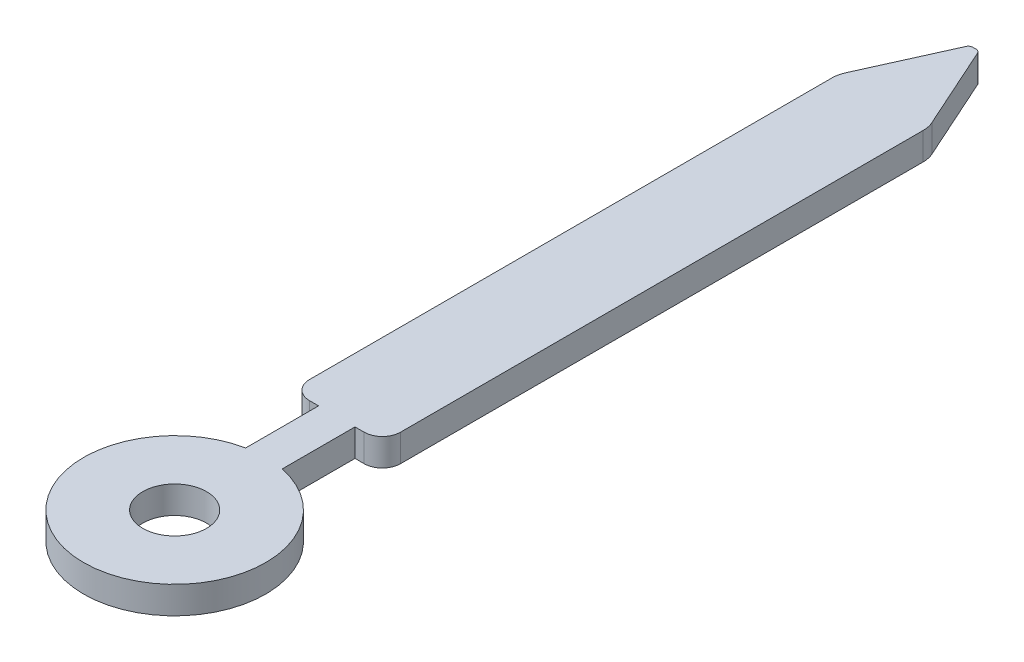
ISO-10303-21;
HEADER;
FILE_DESCRIPTION(('STEP AP214'),'2;1');
FILE_NAME('part.step','',(''),(''),'','','');
FILE_SCHEMA(('AUTOMOTIVE_DESIGN { 1 0 10303 214 1 1 1 1 }'));
ENDSEC;
DATA;
#1=APPLICATION_CONTEXT('core data for automotive mechanical design processes');
#2=APPLICATION_PROTOCOL_DEFINITION('international standard','automotive_design',2000,#1);
#3=PRODUCT_CONTEXT('',#1,'mechanical');
#4=PRODUCT('Part','Part','',(#3));
#5=PRODUCT_RELATED_PRODUCT_CATEGORY('part','',(#4));
#6=PRODUCT_DEFINITION_FORMATION('','',#4);
#7=PRODUCT_DEFINITION_CONTEXT('part definition',#1,'design');
#8=PRODUCT_DEFINITION('design','',#6,#7);
#9=PRODUCT_DEFINITION_SHAPE('','',#8);
#10=(LENGTH_UNIT() NAMED_UNIT(*) SI_UNIT(.MILLI.,.METRE.));
#11=(NAMED_UNIT(*) PLANE_ANGLE_UNIT() SI_UNIT($,.RADIAN.));
#12=(NAMED_UNIT(*) SI_UNIT($,.STERADIAN.) SOLID_ANGLE_UNIT());
#13=UNCERTAINTY_MEASURE_WITH_UNIT(LENGTH_MEASURE(1.E-05),#10,'distance_accuracy_value','');
#14=(GEOMETRIC_REPRESENTATION_CONTEXT(3) GLOBAL_UNCERTAINTY_ASSIGNED_CONTEXT((#13)) GLOBAL_UNIT_ASSIGNED_CONTEXT((#10,
#11,#12)) REPRESENTATION_CONTEXT('',''));
#15=CARTESIAN_POINT('',(0.,0.,0.));
#16=DIRECTION('',(0.,0.,1.));
#17=DIRECTION('',(1.,0.,0.));
#18=AXIS2_PLACEMENT_3D('',#15,#16,#17);
#19=CARTESIAN_POINT('',(-0.0183173051113198,0.3,-6.951));
#20=DIRECTION('',(0.,-1.,0.));
#21=DIRECTION('',(0.,0.,-1.));
#22=AXIS2_PLACEMENT_3D('',#19,#20,#21);
#23=PLANE('',#22);
#24=CARTESIAN_POINT('',(-0.0183173051113198,0.3,-6.951));
#25=DIRECTION('',(0.,1.,0.));
#26=DIRECTION('',(0.,0.,-1.));
#27=AXIS2_PLACEMENT_3D('',#24,#25,#26);
#28=CIRCLE('',#27,0.0489999999999997);
#29=CARTESIAN_POINT('',(-0.0183173051113195,0.3,-7.));
#30=VERTEX_POINT('',#29);
#31=CARTESIAN_POINT('',(-0.0630014588649001,0.3,-6.97110786918911));
#32=VERTEX_POINT('',#31);
#33=EDGE_CURVE('E207',#30,#32,#28,.T.);
#34=ORIENTED_EDGE('',*,*,#33,.T.);
#35=DIRECTION('',(-0.410364677328798,0.,0.911921505175106));
#36=VECTOR('',#35,1.);
#37=CARTESIAN_POINT('',(-0.0630014588649001,0.3,-6.97110786918911));
#38=LINE('',#37,#36);
#39=CARTESIAN_POINT('',(-0.473576451552531,0.3,-6.05871899654993));
#40=VERTEX_POINT('',#39);
#41=EDGE_CURVE('E115',#32,#40,#38,.T.);
#42=ORIENTED_EDGE('',*,*,#41,.T.);
#43=CARTESIAN_POINT('',(-0.2,0.3,-5.93560959335129));
#44=DIRECTION('',(0.,1.,0.));
#45=DIRECTION('',(0.,0.,1.));
#46=AXIS2_PLACEMENT_3D('',#43,#44,#45);
#47=CIRCLE('',#46,0.3);
#48=CARTESIAN_POINT('',(-0.5,0.3,-5.93560959335129));
#49=VERTEX_POINT('',#48);
#50=EDGE_CURVE('E246',#40,#49,#47,.T.);
#51=ORIENTED_EDGE('',*,*,#50,.T.);
#52=DIRECTION('',(0.,0.,1.));
#53=VECTOR('',#52,1.);
#54=CARTESIAN_POINT('',(-0.5,0.3,-0.200000000000001));
#55=LINE('',#54,#53);
#56=CARTESIAN_POINT('',(-0.5,0.3,-0.200000000000001));
#57=VERTEX_POINT('',#56);
#58=EDGE_CURVE('E265',#49,#57,#55,.T.);
#59=ORIENTED_EDGE('',*,*,#58,.T.);
#60=CARTESIAN_POINT('',(-0.3,0.3,-0.2));
#61=DIRECTION('',(0.,1.,0.));
#62=DIRECTION('',(0.,0.,-1.));
#63=AXIS2_PLACEMENT_3D('',#60,#61,#62);
#64=CIRCLE('',#63,0.2);
#65=CARTESIAN_POINT('',(-0.299999999999999,0.3,0.));
#66=VERTEX_POINT('',#65);
#67=EDGE_CURVE('E262',#57,#66,#64,.T.);
#68=ORIENTED_EDGE('',*,*,#67,.T.);
#69=DIRECTION('',(1.,0.,0.));
#70=VECTOR('',#69,1.);
#71=CARTESIAN_POINT('',(-0.299999999999999,0.3,0.));
#72=LINE('',#71,#70);
#73=CARTESIAN_POINT('',(-0.2,0.3,0.));
#74=VERTEX_POINT('',#73);
#75=EDGE_CURVE('E264',#66,#74,#72,.T.);
#76=ORIENTED_EDGE('',*,*,#75,.T.);
#77=DIRECTION('',(0.,0.,1.));
#78=VECTOR('',#77,1.);
#79=CARTESIAN_POINT('',(-0.2,0.3,0.));
#80=LINE('',#79,#78);
#81=CARTESIAN_POINT('',(-0.199999999999999,0.3,0.8));
#82=VERTEX_POINT('',#81);
#83=EDGE_CURVE('E267',#74,#82,#80,.T.);
#84=ORIENTED_EDGE('',*,*,#83,.T.);
#85=CARTESIAN_POINT('',(0.,0.3,1.77979589711327));
#86=DIRECTION('',(0.,1.,0.));
#87=DIRECTION('',(0.,0.,1.));
#88=AXIS2_PLACEMENT_3D('',#85,#86,#87);
#89=CIRCLE('',#88,1.);
#90=CARTESIAN_POINT('',(0.200000000000001,0.3,0.8));
#91=VERTEX_POINT('',#90);
#92=EDGE_CURVE('E273',#82,#91,#89,.T.);
#93=ORIENTED_EDGE('',*,*,#92,.T.);
#94=DIRECTION('',(0.,0.,-1.));
#95=VECTOR('',#94,1.);
#96=CARTESIAN_POINT('',(0.2,0.3,0.));
#97=LINE('',#96,#95);
#98=CARTESIAN_POINT('',(0.2,0.3,0.));
#99=VERTEX_POINT('',#98);
#100=EDGE_CURVE('E275',#91,#99,#97,.T.);
#101=ORIENTED_EDGE('',*,*,#100,.T.);
#102=DIRECTION('',(1.,0.,0.));
#103=VECTOR('',#102,1.);
#104=CARTESIAN_POINT('',(0.2,0.3,0.));
#105=LINE('',#104,#103);
#106=CARTESIAN_POINT('',(0.299999999999999,0.3,0.));
#107=VERTEX_POINT('',#106);
#108=EDGE_CURVE('E277',#99,#107,#105,.T.);
#109=ORIENTED_EDGE('',*,*,#108,.T.);
#110=CARTESIAN_POINT('',(0.3,0.3,-0.2));
#111=DIRECTION('',(0.,1.,0.));
#112=DIRECTION('',(0.,0.,1.));
#113=AXIS2_PLACEMENT_3D('',#110,#111,#112);
#114=CIRCLE('',#113,0.2);
#115=CARTESIAN_POINT('',(0.5,0.3,-0.200000000000001));
#116=VERTEX_POINT('',#115);
#117=EDGE_CURVE('E279',#107,#116,#114,.T.);
#118=ORIENTED_EDGE('',*,*,#117,.T.);
#119=DIRECTION('',(0.,0.,-1.));
#120=VECTOR('',#119,1.);
#121=CARTESIAN_POINT('',(0.5,0.3,-0.200000000000001));
#122=LINE('',#121,#120);
#123=CARTESIAN_POINT('',(0.5,0.3,-5.93560959335129));
#124=VERTEX_POINT('',#123);
#125=EDGE_CURVE('E281',#116,#124,#122,.T.);
#126=ORIENTED_EDGE('',*,*,#125,.T.);
#127=CARTESIAN_POINT('',(0.2,0.3,-5.93560959335129));
#128=DIRECTION('',(0.,1.,0.));
#129=DIRECTION('',(0.,0.,-1.));
#130=AXIS2_PLACEMENT_3D('',#127,#128,#129);
#131=CIRCLE('',#130,0.3);
#132=CARTESIAN_POINT('',(0.473576451552531,0.3,-6.05871899654993));
#133=VERTEX_POINT('',#132);
#134=EDGE_CURVE('E158',#124,#133,#131,.T.);
#135=ORIENTED_EDGE('',*,*,#134,.T.);
#136=DIRECTION('',(-0.410364677328798,0.,-0.911921505175106));
#137=VECTOR('',#136,1.);
#138=CARTESIAN_POINT('',(0.0630014588649001,0.3,-6.97110786918911));
#139=LINE('',#138,#137);
#140=CARTESIAN_POINT('',(0.0630014588649001,0.3,-6.97110786918911));
#141=VERTEX_POINT('',#140);
#142=EDGE_CURVE('E152',#133,#141,#139,.T.);
#143=ORIENTED_EDGE('',*,*,#142,.T.);
#144=CARTESIAN_POINT('',(0.0183173051113198,0.3,-6.951));
#145=DIRECTION('',(0.,1.,0.));
#146=DIRECTION('',(0.,0.,1.));
#147=AXIS2_PLACEMENT_3D('',#144,#145,#146);
#148=CIRCLE('',#147,0.0489999999999997);
#149=CARTESIAN_POINT('',(0.0183173051113196,0.3,-7.));
#150=VERTEX_POINT('',#149);
#151=EDGE_CURVE('E156',#141,#150,#148,.T.);
#152=ORIENTED_EDGE('',*,*,#151,.T.);
#153=DIRECTION('',(-1.,0.,0.));
#154=VECTOR('',#153,1.);
#155=CARTESIAN_POINT('',(-0.0183173051113195,0.3,-7.));
#156=LINE('',#155,#154);
#157=EDGE_CURVE('E48',#150,#30,#156,.T.);
#158=ORIENTED_EDGE('',*,*,#157,.T.);
#159=EDGE_LOOP('',(#34,#42,#51,#59,#68,#76,#84,#93,#101,#109,#118,#126,#135,#143,#152,#158));
#160=FACE_BOUND('',#159,.T.);
#161=CARTESIAN_POINT('',(0.,0.3,1.77979589711327));
#162=DIRECTION('',(0.,1.,0.));
#163=DIRECTION('',(0.,0.,1.));
#164=AXIS2_PLACEMENT_3D('',#161,#162,#163);
#165=CIRCLE('',#164,0.35);
#166=CARTESIAN_POINT('',(0.,0.3,2.12979589711327));
#167=VERTEX_POINT('',#166);
#168=EDGE_CURVE('E180',#167,#167,#165,.T.);
#169=ORIENTED_EDGE('',*,*,#168,.F.);
#170=EDGE_LOOP('',(#169));
#171=FACE_BOUND('',#170,.T.);
#172=ADVANCED_FACE('F31',(#160,#171),#23,.F.);
#173=CARTESIAN_POINT('',(-0.0183173051113198,0.,-6.951));
#174=DIRECTION('',(0.,-1.,0.));
#175=DIRECTION('',(0.,0.,-1.));
#176=AXIS2_PLACEMENT_3D('',#173,#174,#175);
#177=PLANE('',#176);
#178=CARTESIAN_POINT('',(-0.0183173051113198,0.,-6.951));
#179=DIRECTION('',(0.,1.,0.));
#180=DIRECTION('',(0.,0.,-1.));
#181=AXIS2_PLACEMENT_3D('',#178,#179,#180);
#182=CIRCLE('',#181,0.0489999999999997);
#183=CARTESIAN_POINT('',(-0.0183173051113195,0.,-7.));
#184=VERTEX_POINT('',#183);
#185=CARTESIAN_POINT('',(-0.0630014588649001,0.,-6.97110786918911));
#186=VERTEX_POINT('',#185);
#187=EDGE_CURVE('E176',#184,#186,#182,.T.);
#188=ORIENTED_EDGE('',*,*,#187,.F.);
#189=DIRECTION('',(-1.,0.,0.));
#190=VECTOR('',#189,1.);
#191=CARTESIAN_POINT('',(-0.0183173051113195,0.,-7.));
#192=LINE('',#191,#190);
#193=CARTESIAN_POINT('',(0.0183173051113196,0.,-7.));
#194=VERTEX_POINT('',#193);
#195=EDGE_CURVE('E107',#194,#184,#192,.T.);
#196=ORIENTED_EDGE('',*,*,#195,.F.);
#197=CARTESIAN_POINT('',(0.0183173051113198,0.,-6.951));
#198=DIRECTION('',(0.,1.,0.));
#199=DIRECTION('',(0.,0.,1.));
#200=AXIS2_PLACEMENT_3D('',#197,#198,#199);
#201=CIRCLE('',#200,0.0489999999999997);
#202=CARTESIAN_POINT('',(0.0630014588649001,0.,-6.97110786918911));
#203=VERTEX_POINT('',#202);
#204=EDGE_CURVE('E101',#203,#194,#201,.T.);
#205=ORIENTED_EDGE('',*,*,#204,.F.);
#206=DIRECTION('',(-0.410364677328798,0.,-0.911921505175106));
#207=VECTOR('',#206,1.);
#208=CARTESIAN_POINT('',(0.0630014588649001,0.,-6.97110786918911));
#209=LINE('',#208,#207);
#210=CARTESIAN_POINT('',(0.473576451552531,0.,-6.05871899654993));
#211=VERTEX_POINT('',#210);
#212=EDGE_CURVE('E166',#211,#203,#209,.T.);
#213=ORIENTED_EDGE('',*,*,#212,.F.);
#214=CARTESIAN_POINT('',(0.2,0.,-5.93560959335129));
#215=DIRECTION('',(0.,1.,0.));
#216=DIRECTION('',(0.,0.,-1.));
#217=AXIS2_PLACEMENT_3D('',#214,#215,#216);
#218=CIRCLE('',#217,0.3);
#219=CARTESIAN_POINT('',(0.5,0.,-5.93560959335129));
#220=VERTEX_POINT('',#219);
#221=EDGE_CURVE('E202',#220,#211,#218,.T.);
#222=ORIENTED_EDGE('',*,*,#221,.F.);
#223=DIRECTION('',(0.,0.,-1.));
#224=VECTOR('',#223,1.);
#225=CARTESIAN_POINT('',(0.5,0.,-0.200000000000001));
#226=LINE('',#225,#224);
#227=CARTESIAN_POINT('',(0.5,0.,-0.200000000000001));
#228=VERTEX_POINT('',#227);
#229=EDGE_CURVE('E200',#228,#220,#226,.T.);
#230=ORIENTED_EDGE('',*,*,#229,.F.);
#231=CARTESIAN_POINT('',(0.3,0.,-0.2));
#232=DIRECTION('',(0.,1.,0.));
#233=DIRECTION('',(0.,0.,1.));
#234=AXIS2_PLACEMENT_3D('',#231,#232,#233);
#235=CIRCLE('',#234,0.2);
#236=CARTESIAN_POINT('',(0.299999999999999,0.,0.));
#237=VERTEX_POINT('',#236);
#238=EDGE_CURVE('E198',#237,#228,#235,.T.);
#239=ORIENTED_EDGE('',*,*,#238,.F.);
#240=DIRECTION('',(1.,0.,0.));
#241=VECTOR('',#240,1.);
#242=CARTESIAN_POINT('',(0.2,0.,0.));
#243=LINE('',#242,#241);
#244=CARTESIAN_POINT('',(0.2,0.,0.));
#245=VERTEX_POINT('',#244);
#246=EDGE_CURVE('E196',#245,#237,#243,.T.);
#247=ORIENTED_EDGE('',*,*,#246,.F.);
#248=DIRECTION('',(0.,0.,-1.));
#249=VECTOR('',#248,1.);
#250=CARTESIAN_POINT('',(0.2,0.,0.));
#251=LINE('',#250,#249);
#252=CARTESIAN_POINT('',(0.200000000000001,0.,0.8));
#253=VERTEX_POINT('',#252);
#254=EDGE_CURVE('E194',#253,#245,#251,.T.);
#255=ORIENTED_EDGE('',*,*,#254,.F.);
#256=CARTESIAN_POINT('',(0.,0.,1.77979589711327));
#257=DIRECTION('',(0.,1.,0.));
#258=DIRECTION('',(0.,0.,1.));
#259=AXIS2_PLACEMENT_3D('',#256,#257,#258);
#260=CIRCLE('',#259,1.);
#261=CARTESIAN_POINT('',(-0.199999999999999,0.,0.8));
#262=VERTEX_POINT('',#261);
#263=EDGE_CURVE('E192',#262,#253,#260,.T.);
#264=ORIENTED_EDGE('',*,*,#263,.F.);
#265=DIRECTION('',(0.,0.,1.));
#266=VECTOR('',#265,1.);
#267=CARTESIAN_POINT('',(-0.2,0.,0.));
#268=LINE('',#267,#266);
#269=CARTESIAN_POINT('',(-0.2,0.,0.));
#270=VERTEX_POINT('',#269);
#271=EDGE_CURVE('E190',#270,#262,#268,.T.);
#272=ORIENTED_EDGE('',*,*,#271,.F.);
#273=DIRECTION('',(1.,0.,0.));
#274=VECTOR('',#273,1.);
#275=CARTESIAN_POINT('',(-0.299999999999999,0.,0.));
#276=LINE('',#275,#274);
#277=CARTESIAN_POINT('',(-0.299999999999999,0.,0.));
#278=VERTEX_POINT('',#277);
#279=EDGE_CURVE('E188',#278,#270,#276,.T.);
#280=ORIENTED_EDGE('',*,*,#279,.F.);
#281=CARTESIAN_POINT('',(-0.3,0.,-0.2));
#282=DIRECTION('',(0.,1.,0.));
#283=DIRECTION('',(0.,0.,-1.));
#284=AXIS2_PLACEMENT_3D('',#281,#282,#283);
#285=CIRCLE('',#284,0.2);
#286=CARTESIAN_POINT('',(-0.5,0.,-0.200000000000001));
#287=VERTEX_POINT('',#286);
#288=EDGE_CURVE('E186',#287,#278,#285,.T.);
#289=ORIENTED_EDGE('',*,*,#288,.F.);
#290=DIRECTION('',(0.,0.,1.));
#291=VECTOR('',#290,1.);
#292=CARTESIAN_POINT('',(-0.5,0.,-0.200000000000001));
#293=LINE('',#292,#291);
#294=CARTESIAN_POINT('',(-0.5,0.,-5.93560959335129));
#295=VERTEX_POINT('',#294);
#296=EDGE_CURVE('E184',#295,#287,#293,.T.);
#297=ORIENTED_EDGE('',*,*,#296,.F.);
#298=CARTESIAN_POINT('',(-0.2,0.,-5.93560959335129));
#299=DIRECTION('',(0.,1.,0.));
#300=DIRECTION('',(0.,0.,1.));
#301=AXIS2_PLACEMENT_3D('',#298,#299,#300);
#302=CIRCLE('',#301,0.3);
#303=CARTESIAN_POINT('',(-0.473576451552531,0.,-6.05871899654993));
#304=VERTEX_POINT('',#303);
#305=EDGE_CURVE('E182',#304,#295,#302,.T.);
#306=ORIENTED_EDGE('',*,*,#305,.F.);
#307=DIRECTION('',(-0.410364677328798,0.,0.911921505175106));
#308=VECTOR('',#307,1.);
#309=CARTESIAN_POINT('',(-0.0630014588649001,0.,-6.97110786918911));
#310=LINE('',#309,#308);
#311=EDGE_CURVE('E179',#186,#304,#310,.T.);
#312=ORIENTED_EDGE('',*,*,#311,.F.);
#313=EDGE_LOOP('',(#188,#196,#205,#213,#222,#230,#239,#247,#255,#264,#272,#280,#289,#297,#306,#312));
#314=FACE_BOUND('',#313,.T.);
#315=CARTESIAN_POINT('',(0.,0.,1.77979589711327));
#316=DIRECTION('',(0.,1.,0.));
#317=DIRECTION('',(0.,0.,1.));
#318=AXIS2_PLACEMENT_3D('',#315,#316,#317);
#319=CIRCLE('',#318,0.35);
#320=CARTESIAN_POINT('',(0.,0.,2.12979589711327));
#321=VERTEX_POINT('',#320);
#322=EDGE_CURVE('E480',#321,#321,#319,.T.);
#323=ORIENTED_EDGE('',*,*,#322,.T.);
#324=EDGE_LOOP('',(#323));
#325=FACE_BOUND('',#324,.T.);
#326=ADVANCED_FACE('F250',(#314,#325),#177,.T.);
#327=CARTESIAN_POINT('',(-0.0183173051113198,0.3,-6.951));
#328=DIRECTION('',(0.,-1.,0.));
#329=DIRECTION('',(0.,0.,-1.));
#330=AXIS2_PLACEMENT_3D('',#327,#328,#329);
#331=CYLINDRICAL_SURFACE('',#330,0.0489999999999997);
#332=ORIENTED_EDGE('',*,*,#187,.T.);
#333=DIRECTION('',(0.,-1.,0.));
#334=VECTOR('',#333,1.);
#335=CARTESIAN_POINT('',(-0.0630014588649001,0.3,-6.97110786918911));
#336=LINE('',#335,#334);
#337=EDGE_CURVE('E11',#32,#186,#336,.T.);
#338=ORIENTED_EDGE('',*,*,#337,.F.);
#339=ORIENTED_EDGE('',*,*,#33,.F.);
#340=DIRECTION('',(0.,-1.,0.));
#341=VECTOR('',#340,1.);
#342=CARTESIAN_POINT('',(-0.0183173051113195,0.3,-7.));
#343=LINE('',#342,#341);
#344=EDGE_CURVE('E172',#30,#184,#343,.T.);
#345=ORIENTED_EDGE('',*,*,#344,.T.);
#346=EDGE_LOOP('',(#332,#338,#339,#345));
#347=FACE_BOUND('',#346,.T.);
#348=ADVANCED_FACE('F33',(#347),#331,.T.);
#349=CARTESIAN_POINT('',(-0.0630014588649001,0.3,-6.97110786918911));
#350=DIRECTION('',(0.911921505175106,0.,0.410364677328798));
#351=DIRECTION('',(0.410364677328798,0.,-0.911921505175106));
#352=AXIS2_PLACEMENT_3D('',#349,#350,#351);
#353=PLANE('',#352);
#354=ORIENTED_EDGE('',*,*,#311,.T.);
#355=DIRECTION('',(0.,-1.,0.));
#356=VECTOR('',#355,1.);
#357=CARTESIAN_POINT('',(-0.473576451552531,0.3,-6.05871899654993));
#358=LINE('',#357,#356);
#359=EDGE_CURVE('E40',#40,#304,#358,.T.);
#360=ORIENTED_EDGE('',*,*,#359,.F.);
#361=ORIENTED_EDGE('',*,*,#41,.F.);
#362=ORIENTED_EDGE('',*,*,#337,.T.);
#363=EDGE_LOOP('',(#354,#360,#361,#362));
#364=FACE_BOUND('',#363,.T.);
#365=ADVANCED_FACE('F315',(#364),#353,.F.);
#366=CARTESIAN_POINT('',(-0.2,0.3,-5.93560959335129));
#367=DIRECTION('',(0.,-1.,0.));
#368=DIRECTION('',(0.,0.,-1.));
#369=AXIS2_PLACEMENT_3D('',#366,#367,#368);
#370=CYLINDRICAL_SURFACE('',#369,0.3);
#371=ORIENTED_EDGE('',*,*,#305,.T.);
#372=DIRECTION('',(0.,-1.,0.));
#373=VECTOR('',#372,1.);
#374=CARTESIAN_POINT('',(-0.5,0.3,-5.93560959335129));
#375=LINE('',#374,#373);
#376=EDGE_CURVE('E238',#49,#295,#375,.T.);
#377=ORIENTED_EDGE('',*,*,#376,.F.);
#378=ORIENTED_EDGE('',*,*,#50,.F.);
#379=ORIENTED_EDGE('',*,*,#359,.T.);
#380=EDGE_LOOP('',(#371,#377,#378,#379));
#381=FACE_BOUND('',#380,.T.);
#382=ADVANCED_FACE('F244',(#381),#370,.T.);
#383=CARTESIAN_POINT('',(-0.5,0.3,-0.200000000000001));
#384=DIRECTION('',(1.,0.,0.));
#385=DIRECTION('',(0.,0.,-1.));
#386=AXIS2_PLACEMENT_3D('',#383,#384,#385);
#387=PLANE('',#386);
#388=ORIENTED_EDGE('',*,*,#296,.T.);
#389=DIRECTION('',(0.,-1.,0.));
#390=VECTOR('',#389,1.);
#391=CARTESIAN_POINT('',(-0.5,0.3,-0.200000000000001));
#392=LINE('',#391,#390);
#393=EDGE_CURVE('E235',#57,#287,#392,.T.);
#394=ORIENTED_EDGE('',*,*,#393,.F.);
#395=ORIENTED_EDGE('',*,*,#58,.F.);
#396=ORIENTED_EDGE('',*,*,#376,.T.);
#397=EDGE_LOOP('',(#388,#394,#395,#396));
#398=FACE_BOUND('',#397,.T.);
#399=ADVANCED_FACE('F256',(#398),#387,.F.);
#400=CARTESIAN_POINT('',(-0.3,0.3,-0.2));
#401=DIRECTION('',(0.,-1.,0.));
#402=DIRECTION('',(0.,0.,-1.));
#403=AXIS2_PLACEMENT_3D('',#400,#401,#402);
#404=CYLINDRICAL_SURFACE('',#403,0.2);
#405=ORIENTED_EDGE('',*,*,#288,.T.);
#406=DIRECTION('',(0.,-1.,0.));
#407=VECTOR('',#406,1.);
#408=CARTESIAN_POINT('',(-0.299999999999999,0.3,0.));
#409=LINE('',#408,#407);
#410=EDGE_CURVE('E232',#66,#278,#409,.T.);
#411=ORIENTED_EDGE('',*,*,#410,.F.);
#412=ORIENTED_EDGE('',*,*,#67,.F.);
#413=ORIENTED_EDGE('',*,*,#393,.T.);
#414=EDGE_LOOP('',(#405,#411,#412,#413));
#415=FACE_BOUND('',#414,.T.);
#416=ADVANCED_FACE('F260',(#415),#404,.T.);
#417=CARTESIAN_POINT('',(-0.299999999999999,0.3,0.));
#418=DIRECTION('',(0.,0.,-1.));
#419=DIRECTION('',(-1.,0.,0.));
#420=AXIS2_PLACEMENT_3D('',#417,#418,#419);
#421=PLANE('',#420);
#422=ORIENTED_EDGE('',*,*,#279,.T.);
#423=DIRECTION('',(0.,-1.,0.));
#424=VECTOR('',#423,1.);
#425=CARTESIAN_POINT('',(-0.2,0.3,0.));
#426=LINE('',#425,#424);
#427=EDGE_CURVE('E229',#74,#270,#426,.T.);
#428=ORIENTED_EDGE('',*,*,#427,.F.);
#429=ORIENTED_EDGE('',*,*,#75,.F.);
#430=ORIENTED_EDGE('',*,*,#410,.T.);
#431=EDGE_LOOP('',(#422,#428,#429,#430));
#432=FACE_BOUND('',#431,.T.);
#433=ADVANCED_FACE('F328',(#432),#421,.F.);
#434=CARTESIAN_POINT('',(-0.2,0.3,0.));
#435=DIRECTION('',(1.,0.,0.));
#436=DIRECTION('',(0.,0.,-1.));
#437=AXIS2_PLACEMENT_3D('',#434,#435,#436);
#438=PLANE('',#437);
#439=ORIENTED_EDGE('',*,*,#271,.T.);
#440=DIRECTION('',(0.,-1.,0.));
#441=VECTOR('',#440,1.);
#442=CARTESIAN_POINT('',(-0.199999999999999,0.3,0.8));
#443=LINE('',#442,#441);
#444=EDGE_CURVE('E226',#82,#262,#443,.T.);
#445=ORIENTED_EDGE('',*,*,#444,.F.);
#446=ORIENTED_EDGE('',*,*,#83,.F.);
#447=ORIENTED_EDGE('',*,*,#427,.T.);
#448=EDGE_LOOP('',(#439,#445,#446,#447));
#449=FACE_BOUND('',#448,.T.);
#450=ADVANCED_FACE('F331',(#449),#438,.F.);
#451=CARTESIAN_POINT('',(0.,0.3,1.77979589711327));
#452=DIRECTION('',(0.,-1.,0.));
#453=DIRECTION('',(0.,0.,-1.));
#454=AXIS2_PLACEMENT_3D('',#451,#452,#453);
#455=CYLINDRICAL_SURFACE('',#454,1.);
#456=ORIENTED_EDGE('',*,*,#263,.T.);
#457=DIRECTION('',(0.,-1.,0.));
#458=VECTOR('',#457,1.);
#459=CARTESIAN_POINT('',(0.200000000000001,0.3,0.8));
#460=LINE('',#459,#458);
#461=EDGE_CURVE('E223',#91,#253,#460,.T.);
#462=ORIENTED_EDGE('',*,*,#461,.F.);
#463=ORIENTED_EDGE('',*,*,#92,.F.);
#464=ORIENTED_EDGE('',*,*,#444,.T.);
#465=EDGE_LOOP('',(#456,#462,#463,#464));
#466=FACE_BOUND('',#465,.T.);
#467=ADVANCED_FACE('F335',(#466),#455,.T.);
#468=CARTESIAN_POINT('',(0.2,0.3,0.));
#469=DIRECTION('',(-1.,0.,0.));
#470=DIRECTION('',(0.,0.,1.));
#471=AXIS2_PLACEMENT_3D('',#468,#469,#470);
#472=PLANE('',#471);
#473=ORIENTED_EDGE('',*,*,#254,.T.);
#474=DIRECTION('',(0.,-1.,0.));
#475=VECTOR('',#474,1.);
#476=CARTESIAN_POINT('',(0.2,0.3,0.));
#477=LINE('',#476,#475);
#478=EDGE_CURVE('E220',#99,#245,#477,.T.);
#479=ORIENTED_EDGE('',*,*,#478,.F.);
#480=ORIENTED_EDGE('',*,*,#100,.F.);
#481=ORIENTED_EDGE('',*,*,#461,.T.);
#482=EDGE_LOOP('',(#473,#479,#480,#481));
#483=FACE_BOUND('',#482,.T.);
#484=ADVANCED_FACE('F339',(#483),#472,.F.);
#485=CARTESIAN_POINT('',(0.2,0.3,0.));
#486=DIRECTION('',(0.,0.,-1.));
#487=DIRECTION('',(-1.,0.,0.));
#488=AXIS2_PLACEMENT_3D('',#485,#486,#487);
#489=PLANE('',#488);
#490=ORIENTED_EDGE('',*,*,#246,.T.);
#491=DIRECTION('',(0.,-1.,0.));
#492=VECTOR('',#491,1.);
#493=CARTESIAN_POINT('',(0.299999999999999,0.3,0.));
#494=LINE('',#493,#492);
#495=EDGE_CURVE('E217',#107,#237,#494,.T.);
#496=ORIENTED_EDGE('',*,*,#495,.F.);
#497=ORIENTED_EDGE('',*,*,#108,.F.);
#498=ORIENTED_EDGE('',*,*,#478,.T.);
#499=EDGE_LOOP('',(#490,#496,#497,#498));
#500=FACE_BOUND('',#499,.T.);
#501=ADVANCED_FACE('F343',(#500),#489,.F.);
#502=CARTESIAN_POINT('',(0.3,0.3,-0.2));
#503=DIRECTION('',(0.,-1.,0.));
#504=DIRECTION('',(0.,0.,-1.));
#505=AXIS2_PLACEMENT_3D('',#502,#503,#504);
#506=CYLINDRICAL_SURFACE('',#505,0.2);
#507=ORIENTED_EDGE('',*,*,#238,.T.);
#508=DIRECTION('',(0.,-1.,0.));
#509=VECTOR('',#508,1.);
#510=CARTESIAN_POINT('',(0.5,0.3,-0.200000000000001));
#511=LINE('',#510,#509);
#512=EDGE_CURVE('E214',#116,#228,#511,.T.);
#513=ORIENTED_EDGE('',*,*,#512,.F.);
#514=ORIENTED_EDGE('',*,*,#117,.F.);
#515=ORIENTED_EDGE('',*,*,#495,.T.);
#516=EDGE_LOOP('',(#507,#513,#514,#515));
#517=FACE_BOUND('',#516,.T.);
#518=ADVANCED_FACE('F347',(#517),#506,.T.);
#519=CARTESIAN_POINT('',(0.5,0.3,-0.200000000000001));
#520=DIRECTION('',(-1.,0.,0.));
#521=DIRECTION('',(0.,0.,1.));
#522=AXIS2_PLACEMENT_3D('',#519,#520,#521);
#523=PLANE('',#522);
#524=ORIENTED_EDGE('',*,*,#229,.T.);
#525=DIRECTION('',(0.,-1.,0.));
#526=VECTOR('',#525,1.);
#527=CARTESIAN_POINT('',(0.5,0.3,-5.93560959335129));
#528=LINE('',#527,#526);
#529=EDGE_CURVE('E211',#124,#220,#528,.T.);
#530=ORIENTED_EDGE('',*,*,#529,.F.);
#531=ORIENTED_EDGE('',*,*,#125,.F.);
#532=ORIENTED_EDGE('',*,*,#512,.T.);
#533=EDGE_LOOP('',(#524,#530,#531,#532));
#534=FACE_BOUND('',#533,.T.);
#535=ADVANCED_FACE('F287',(#534),#523,.F.);
#536=CARTESIAN_POINT('',(0.2,0.3,-5.93560959335129));
#537=DIRECTION('',(0.,-1.,0.));
#538=DIRECTION('',(0.,0.,-1.));
#539=AXIS2_PLACEMENT_3D('',#536,#537,#538);
#540=CYLINDRICAL_SURFACE('',#539,0.3);
#541=ORIENTED_EDGE('',*,*,#221,.T.);
#542=DIRECTION('',(0.,-1.,0.));
#543=VECTOR('',#542,1.);
#544=CARTESIAN_POINT('',(0.473576451552531,0.3,-6.05871899654993));
#545=LINE('',#544,#543);
#546=EDGE_CURVE('E167',#133,#211,#545,.T.);
#547=ORIENTED_EDGE('',*,*,#546,.F.);
#548=ORIENTED_EDGE('',*,*,#134,.F.);
#549=ORIENTED_EDGE('',*,*,#529,.T.);
#550=EDGE_LOOP('',(#541,#547,#548,#549));
#551=FACE_BOUND('',#550,.T.);
#552=ADVANCED_FACE('F291',(#551),#540,.T.);
#553=CARTESIAN_POINT('',(0.0630014588649001,0.3,-6.97110786918911));
#554=DIRECTION('',(-0.911921505175106,0.,0.410364677328798));
#555=DIRECTION('',(0.410364677328798,0.,0.911921505175106));
#556=AXIS2_PLACEMENT_3D('',#553,#554,#555);
#557=PLANE('',#556);
#558=ORIENTED_EDGE('',*,*,#212,.T.);
#559=DIRECTION('',(0.,-1.,0.));
#560=VECTOR('',#559,1.);
#561=CARTESIAN_POINT('',(0.0630014588649001,0.3,-6.97110786918911));
#562=LINE('',#561,#560);
#563=EDGE_CURVE('E163',#141,#203,#562,.T.);
#564=ORIENTED_EDGE('',*,*,#563,.F.);
#565=ORIENTED_EDGE('',*,*,#142,.F.);
#566=ORIENTED_EDGE('',*,*,#546,.T.);
#567=EDGE_LOOP('',(#558,#564,#565,#566));
#568=FACE_BOUND('',#567,.T.);
#569=ADVANCED_FACE('F164',(#568),#557,.F.);
#570=CARTESIAN_POINT('',(0.0183173051113198,0.3,-6.951));
#571=DIRECTION('',(0.,-1.,0.));
#572=DIRECTION('',(0.,0.,-1.));
#573=AXIS2_PLACEMENT_3D('',#570,#571,#572);
#574=CYLINDRICAL_SURFACE('',#573,0.0489999999999997);
#575=ORIENTED_EDGE('',*,*,#204,.T.);
#576=DIRECTION('',(0.,-1.,0.));
#577=VECTOR('',#576,1.);
#578=CARTESIAN_POINT('',(0.0183173051113196,0.3,-7.));
#579=LINE('',#578,#577);
#580=EDGE_CURVE('E168',#150,#194,#579,.T.);
#581=ORIENTED_EDGE('',*,*,#580,.F.);
#582=ORIENTED_EDGE('',*,*,#151,.F.);
#583=ORIENTED_EDGE('',*,*,#563,.T.);
#584=EDGE_LOOP('',(#575,#581,#582,#583));
#585=FACE_BOUND('',#584,.T.);
#586=ADVANCED_FACE('F170',(#585),#574,.T.);
#587=CARTESIAN_POINT('',(-0.0183173051113195,0.3,-7.));
#588=DIRECTION('',(0.,0.,1.));
#589=DIRECTION('',(1.,0.,0.));
#590=AXIS2_PLACEMENT_3D('',#587,#588,#589);
#591=PLANE('',#590);
#592=ORIENTED_EDGE('',*,*,#195,.T.);
#593=ORIENTED_EDGE('',*,*,#344,.F.);
#594=ORIENTED_EDGE('',*,*,#157,.F.);
#595=ORIENTED_EDGE('',*,*,#580,.T.);
#596=EDGE_LOOP('',(#592,#593,#594,#595));
#597=FACE_BOUND('',#596,.T.);
#598=ADVANCED_FACE('F295',(#597),#591,.F.);
#599=CARTESIAN_POINT('',(0.,0.3,1.77979589711327));
#600=DIRECTION('',(0.,-1.,0.));
#601=DIRECTION('',(0.,0.,-1.));
#602=AXIS2_PLACEMENT_3D('',#599,#600,#601);
#603=CYLINDRICAL_SURFACE('',#602,0.35);
#604=ORIENTED_EDGE('',*,*,#168,.T.);
#605=EDGE_LOOP('',(#604));
#606=FACE_BOUND('',#605,.T.);
#607=ORIENTED_EDGE('',*,*,#322,.F.);
#608=EDGE_LOOP('',(#607));
#609=FACE_BOUND('',#608,.T.);
#610=ADVANCED_FACE('F297',(#606,#609),#603,.F.);
#611=CLOSED_SHELL('',(#172,#326,#348,#365,#382,#399,#416,#433,#450,#467,#484,#501,#518,#535,
#552,#569,#586,#598,#610));
#612=MANIFOLD_SOLID_BREP('B2',#611);
#613=ADVANCED_BREP_SHAPE_REPRESENTATION('',(#18,#612),#14);
#614=SHAPE_DEFINITION_REPRESENTATION(#9,#613);
ENDSEC;
END-ISO-10303-21;
